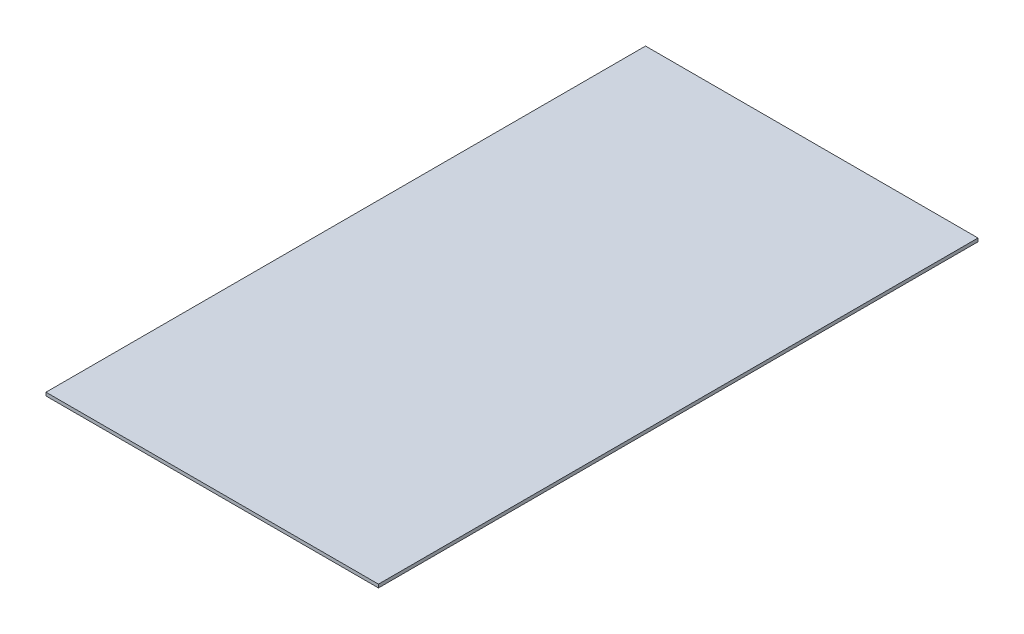
ISO-10303-21;
HEADER;
FILE_DESCRIPTION(('STEP AP214'),'2;1');
FILE_NAME('part.step','',(''),(''),'','','');
FILE_SCHEMA(('AUTOMOTIVE_DESIGN { 1 0 10303 214 1 1 1 1 }'));
ENDSEC;
DATA;
#1=APPLICATION_CONTEXT('core data for automotive mechanical design processes');
#2=APPLICATION_PROTOCOL_DEFINITION('international standard','automotive_design',2000,#1);
#3=PRODUCT_CONTEXT('',#1,'mechanical');
#4=PRODUCT('Part','Part','',(#3));
#5=PRODUCT_RELATED_PRODUCT_CATEGORY('part','',(#4));
#6=PRODUCT_DEFINITION_FORMATION('','',#4);
#7=PRODUCT_DEFINITION_CONTEXT('part definition',#1,'design');
#8=PRODUCT_DEFINITION('design','',#6,#7);
#9=PRODUCT_DEFINITION_SHAPE('','',#8);
#10=(LENGTH_UNIT() NAMED_UNIT(*) SI_UNIT(.MILLI.,.METRE.));
#11=(NAMED_UNIT(*) PLANE_ANGLE_UNIT() SI_UNIT($,.RADIAN.));
#12=(NAMED_UNIT(*) SI_UNIT($,.STERADIAN.) SOLID_ANGLE_UNIT());
#13=UNCERTAINTY_MEASURE_WITH_UNIT(LENGTH_MEASURE(1.E-05),#10,'distance_accuracy_value','');
#14=(GEOMETRIC_REPRESENTATION_CONTEXT(3) GLOBAL_UNCERTAINTY_ASSIGNED_CONTEXT((#13)) GLOBAL_UNIT_ASSIGNED_CONTEXT((#10,
#11,#12)) REPRESENTATION_CONTEXT('',''));
#15=CARTESIAN_POINT('',(0.,0.,0.));
#16=DIRECTION('',(0.,0.,1.));
#17=DIRECTION('',(1.,0.,0.));
#18=AXIS2_PLACEMENT_3D('',#15,#16,#17);
#19=CARTESIAN_POINT('',(150.,3.,-270.5));
#20=DIRECTION('',(-1.,0.,0.));
#21=DIRECTION('',(0.,0.,1.));
#22=AXIS2_PLACEMENT_3D('',#19,#20,#21);
#23=PLANE('',#22);
#24=DIRECTION('',(0.,0.,-1.));
#25=VECTOR('',#24,1.);
#26=CARTESIAN_POINT('',(150.,0.,-270.5));
#27=LINE('',#26,#25);
#28=CARTESIAN_POINT('',(150.,0.,270.5));
#29=VERTEX_POINT('',#28);
#30=CARTESIAN_POINT('',(150.,0.,-270.5));
#31=VERTEX_POINT('',#30);
#32=EDGE_CURVE('E100',#29,#31,#27,.T.);
#33=ORIENTED_EDGE('',*,*,#32,.T.);
#34=DIRECTION('',(0.,-1.,0.));
#35=VECTOR('',#34,1.);
#36=CARTESIAN_POINT('',(150.,3.,-270.5));
#37=LINE('',#36,#35);
#38=CARTESIAN_POINT('',(150.,3.,-270.5));
#39=VERTEX_POINT('',#38);
#40=EDGE_CURVE('E11',#39,#31,#37,.T.);
#41=ORIENTED_EDGE('',*,*,#40,.F.);
#42=DIRECTION('',(0.,0.,-1.));
#43=VECTOR('',#42,1.);
#44=CARTESIAN_POINT('',(150.,3.,-270.5));
#45=LINE('',#44,#43);
#46=CARTESIAN_POINT('',(150.,3.,270.5));
#47=VERTEX_POINT('',#46);
#48=EDGE_CURVE('E88',#47,#39,#45,.T.);
#49=ORIENTED_EDGE('',*,*,#48,.F.);
#50=DIRECTION('',(0.,-1.,0.));
#51=VECTOR('',#50,1.);
#52=CARTESIAN_POINT('',(150.,3.,270.5));
#53=LINE('',#52,#51);
#54=EDGE_CURVE('E96',#47,#29,#53,.T.);
#55=ORIENTED_EDGE('',*,*,#54,.T.);
#56=EDGE_LOOP('',(#33,#41,#49,#55));
#57=FACE_BOUND('',#56,.T.);
#58=ADVANCED_FACE('F37',(#57),#23,.F.);
#59=CARTESIAN_POINT('',(-150.,3.,-270.5));
#60=DIRECTION('',(0.,0.,1.));
#61=DIRECTION('',(1.,0.,0.));
#62=AXIS2_PLACEMENT_3D('',#59,#60,#61);
#63=PLANE('',#62);
#64=DIRECTION('',(-1.,0.,0.));
#65=VECTOR('',#64,1.);
#66=CARTESIAN_POINT('',(-150.,0.,-270.5));
#67=LINE('',#66,#65);
#68=CARTESIAN_POINT('',(-150.,0.,-270.5));
#69=VERTEX_POINT('',#68);
#70=EDGE_CURVE('E92',#31,#69,#67,.T.);
#71=ORIENTED_EDGE('',*,*,#70,.T.);
#72=DIRECTION('',(0.,-1.,0.));
#73=VECTOR('',#72,1.);
#74=CARTESIAN_POINT('',(-150.,3.,-270.5));
#75=LINE('',#74,#73);
#76=CARTESIAN_POINT('',(-150.,3.,-270.5));
#77=VERTEX_POINT('',#76);
#78=EDGE_CURVE('E45',#77,#69,#75,.T.);
#79=ORIENTED_EDGE('',*,*,#78,.F.);
#80=DIRECTION('',(-1.,0.,0.));
#81=VECTOR('',#80,1.);
#82=CARTESIAN_POINT('',(-150.,3.,-270.5));
#83=LINE('',#82,#81);
#84=EDGE_CURVE('E83',#39,#77,#83,.T.);
#85=ORIENTED_EDGE('',*,*,#84,.F.);
#86=ORIENTED_EDGE('',*,*,#40,.T.);
#87=EDGE_LOOP('',(#71,#79,#85,#86));
#88=FACE_BOUND('',#87,.T.);
#89=ADVANCED_FACE('F91',(#88),#63,.F.);
#90=CARTESIAN_POINT('',(-150.,3.,-270.5));
#91=DIRECTION('',(1.,0.,0.));
#92=DIRECTION('',(0.,0.,-1.));
#93=AXIS2_PLACEMENT_3D('',#90,#91,#92);
#94=PLANE('',#93);
#95=DIRECTION('',(0.,0.,1.));
#96=VECTOR('',#95,1.);
#97=CARTESIAN_POINT('',(-150.,0.,-270.5));
#98=LINE('',#97,#96);
#99=CARTESIAN_POINT('',(-150.,0.,270.5));
#100=VERTEX_POINT('',#99);
#101=EDGE_CURVE('E70',#69,#100,#98,.T.);
#102=ORIENTED_EDGE('',*,*,#101,.T.);
#103=DIRECTION('',(0.,-1.,0.));
#104=VECTOR('',#103,1.);
#105=CARTESIAN_POINT('',(-150.,3.,270.5));
#106=LINE('',#105,#104);
#107=CARTESIAN_POINT('',(-150.,3.,270.5));
#108=VERTEX_POINT('',#107);
#109=EDGE_CURVE('E93',#108,#100,#106,.T.);
#110=ORIENTED_EDGE('',*,*,#109,.F.);
#111=DIRECTION('',(0.,0.,1.));
#112=VECTOR('',#111,1.);
#113=CARTESIAN_POINT('',(-150.,3.,-270.5));
#114=LINE('',#113,#112);
#115=EDGE_CURVE('E86',#77,#108,#114,.T.);
#116=ORIENTED_EDGE('',*,*,#115,.F.);
#117=ORIENTED_EDGE('',*,*,#78,.T.);
#118=EDGE_LOOP('',(#102,#110,#116,#117));
#119=FACE_BOUND('',#118,.T.);
#120=ADVANCED_FACE('F94',(#119),#94,.F.);
#121=CARTESIAN_POINT('',(-150.,3.,270.5));
#122=DIRECTION('',(0.,0.,-1.));
#123=DIRECTION('',(-1.,0.,0.));
#124=AXIS2_PLACEMENT_3D('',#121,#122,#123);
#125=PLANE('',#124);
#126=DIRECTION('',(1.,0.,0.));
#127=VECTOR('',#126,1.);
#128=CARTESIAN_POINT('',(-150.,0.,270.5));
#129=LINE('',#128,#127);
#130=EDGE_CURVE('E76',#100,#29,#129,.T.);
#131=ORIENTED_EDGE('',*,*,#130,.T.);
#132=ORIENTED_EDGE('',*,*,#54,.F.);
#133=DIRECTION('',(1.,0.,0.));
#134=VECTOR('',#133,1.);
#135=CARTESIAN_POINT('',(-150.,3.,270.5));
#136=LINE('',#135,#134);
#137=EDGE_CURVE('E53',#108,#47,#136,.T.);
#138=ORIENTED_EDGE('',*,*,#137,.F.);
#139=ORIENTED_EDGE('',*,*,#109,.T.);
#140=EDGE_LOOP('',(#131,#132,#138,#139));
#141=FACE_BOUND('',#140,.T.);
#142=ADVANCED_FACE('F107',(#141),#125,.F.);
#143=CARTESIAN_POINT('',(0.,3.,0.));
#144=DIRECTION('',(0.,1.,0.));
#145=DIRECTION('',(0.,0.,1.));
#146=AXIS2_PLACEMENT_3D('',#143,#144,#145);
#147=PLANE('',#146);
#148=ORIENTED_EDGE('',*,*,#48,.T.);
#149=ORIENTED_EDGE('',*,*,#84,.T.);
#150=ORIENTED_EDGE('',*,*,#115,.T.);
#151=ORIENTED_EDGE('',*,*,#137,.T.);
#152=EDGE_LOOP('',(#148,#149,#150,#151));
#153=FACE_BOUND('',#152,.T.);
#154=ADVANCED_FACE('F84',(#153),#147,.T.);
#155=CARTESIAN_POINT('',(0.,0.,0.));
#156=DIRECTION('',(0.,1.,0.));
#157=DIRECTION('',(0.,0.,1.));
#158=AXIS2_PLACEMENT_3D('',#155,#156,#157);
#159=PLANE('',#158);
#160=ORIENTED_EDGE('',*,*,#32,.F.);
#161=ORIENTED_EDGE('',*,*,#130,.F.);
#162=ORIENTED_EDGE('',*,*,#101,.F.);
#163=ORIENTED_EDGE('',*,*,#70,.F.);
#164=EDGE_LOOP('',(#160,#161,#162,#163));
#165=FACE_BOUND('',#164,.T.);
#166=ADVANCED_FACE('F110',(#165),#159,.F.);
#167=CLOSED_SHELL('',(#58,#89,#120,#142,#154,#166));
#168=MANIFOLD_SOLID_BREP('B2',#167);
#169=ADVANCED_BREP_SHAPE_REPRESENTATION('',(#18,#168),#14);
#170=SHAPE_DEFINITION_REPRESENTATION(#9,#169);
ENDSEC;
END-ISO-10303-21;
